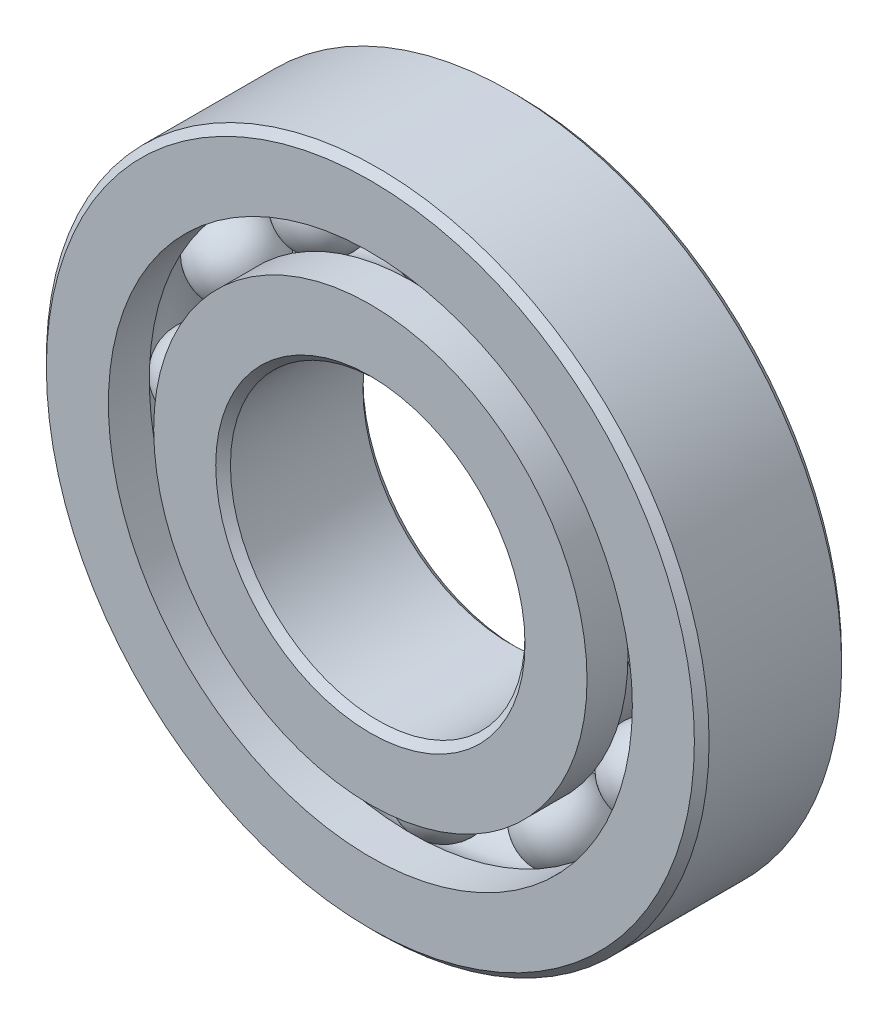
ISO-10303-21;
HEADER;
FILE_DESCRIPTION(('STEP AP214'),'2;1');
FILE_NAME('part.step','',(''),(''),'','','');
FILE_SCHEMA(('AUTOMOTIVE_DESIGN { 1 0 10303 214 1 1 1 1 }'));
ENDSEC;
DATA;
#1=APPLICATION_CONTEXT('core data for automotive mechanical design processes');
#2=APPLICATION_PROTOCOL_DEFINITION('international standard','automotive_design',2000,#1);
#3=PRODUCT_CONTEXT('',#1,'mechanical');
#4=PRODUCT('Part','Part','',(#3));
#5=PRODUCT_RELATED_PRODUCT_CATEGORY('part','',(#4));
#6=PRODUCT_DEFINITION_FORMATION('','',#4);
#7=PRODUCT_DEFINITION_CONTEXT('part definition',#1,'design');
#8=PRODUCT_DEFINITION('design','',#6,#7);
#9=PRODUCT_DEFINITION_SHAPE('','',#8);
#10=(LENGTH_UNIT() NAMED_UNIT(*) SI_UNIT(.MILLI.,.METRE.));
#11=(NAMED_UNIT(*) PLANE_ANGLE_UNIT() SI_UNIT($,.RADIAN.));
#12=(NAMED_UNIT(*) SI_UNIT($,.STERADIAN.) SOLID_ANGLE_UNIT());
#13=UNCERTAINTY_MEASURE_WITH_UNIT(LENGTH_MEASURE(1.E-05),#10,'distance_accuracy_value','');
#14=(GEOMETRIC_REPRESENTATION_CONTEXT(3) GLOBAL_UNCERTAINTY_ASSIGNED_CONTEXT((#13)) GLOBAL_UNIT_ASSIGNED_CONTEXT((#10,
#11,#12)) REPRESENTATION_CONTEXT('',''));
#15=CARTESIAN_POINT('',(0.,0.,0.));
#16=DIRECTION('',(0.,0.,1.));
#17=DIRECTION('',(1.,0.,0.));
#18=AXIS2_PLACEMENT_3D('',#15,#16,#17);
#19=CARTESIAN_POINT('',(-5.15937499999989,8.93629963530074,0.));
#20=DIRECTION('',(0.,0.,1.));
#21=DIRECTION('',(-0.499999999999989,0.866025403784445,0.));
#22=AXIS2_PLACEMENT_3D('',#19,#20,#21);
#23=SPHERICAL_SURFACE('',#22,1.71627890103156);
#24=CARTESIAN_POINT('',(-5.15937499999989,8.93629963530074,1.71627890103155));
#25=VERTEX_POINT('',#24);
#26=VERTEX_LOOP('',#25);
#27=FACE_BOUND('',#26,.T.);
#28=ADVANCED_FACE('F37',(#27),#23,.T.);
#29=CLOSED_SHELL('',(#28));
#30=MANIFOLD_SOLID_BREP('B2',#29);
#31=CARTESIAN_POINT('',(-8.93629963530062,5.1593750000001,0.));
#32=DIRECTION('',(0.,0.,1.));
#33=DIRECTION('',(-0.866025403784433,0.50000000000001,0.));
#34=AXIS2_PLACEMENT_3D('',#31,#32,#33);
#35=SPHERICAL_SURFACE('',#34,1.71627890103156);
#36=CARTESIAN_POINT('',(-8.93629963530062,5.1593750000001,1.71627890103155));
#37=VERTEX_POINT('',#36);
#38=VERTEX_LOOP('',#37);
#39=FACE_BOUND('',#38,.T.);
#40=ADVANCED_FACE('F57',(#39),#35,.T.);
#41=CLOSED_SHELL('',(#40));
#42=MANIFOLD_SOLID_BREP('B6',#41);
#43=CARTESIAN_POINT('',(-10.31875,1.08083231797342E-13,0.));
#44=DIRECTION('',(0.,0.,1.));
#45=DIRECTION('',(-1.,0.,0.));
#46=AXIS2_PLACEMENT_3D('',#43,#44,#45);
#47=SPHERICAL_SURFACE('',#46,1.71627890103156);
#48=CARTESIAN_POINT('',(-10.31875,1.08083231797342E-13,1.71627890103155));
#49=VERTEX_POINT('',#48);
#50=VERTEX_LOOP('',#49);
#51=FACE_BOUND('',#50,.T.);
#52=ADVANCED_FACE('F77',(#51),#47,.T.);
#53=CLOSED_SHELL('',(#52));
#54=MANIFOLD_SOLID_BREP('B33',#53);
#55=CARTESIAN_POINT('',(-8.93629963530072,-5.15937499999992,0.));
#56=DIRECTION('',(0.,0.,1.));
#57=DIRECTION('',(-0.866025403784443,-0.499999999999992,0.));
#58=AXIS2_PLACEMENT_3D('',#55,#56,#57);
#59=SPHERICAL_SURFACE('',#58,1.71627890103156);
#60=CARTESIAN_POINT('',(-8.93629963530072,-5.15937499999992,1.71627890103155));
#61=VERTEX_POINT('',#60);
#62=VERTEX_LOOP('',#61);
#63=FACE_BOUND('',#62,.T.);
#64=ADVANCED_FACE('F97',(#63),#59,.T.);
#65=CLOSED_SHELL('',(#64));
#66=MANIFOLD_SOLID_BREP('B53',#65);
#67=CARTESIAN_POINT('',(-5.15937500000007,-8.93629963530064,0.));
#68=DIRECTION('',(0.,0.,1.));
#69=DIRECTION('',(-0.500000000000007,-0.866025403784435,0.));
#70=AXIS2_PLACEMENT_3D('',#67,#68,#69);
#71=SPHERICAL_SURFACE('',#70,1.71627890103156);
#72=CARTESIAN_POINT('',(-5.15937500000007,-8.93629963530064,1.71627890103155));
#73=VERTEX_POINT('',#72);
#74=VERTEX_LOOP('',#73);
#75=FACE_BOUND('',#74,.T.);
#76=ADVANCED_FACE('F117',(#75),#71,.T.);
#77=CLOSED_SHELL('',(#76));
#78=MANIFOLD_SOLID_BREP('B73',#77);
#79=CARTESIAN_POINT('',(0.,-10.31875,0.));
#80=DIRECTION('',(0.,0.,1.));
#81=DIRECTION('',(0.,-1.,0.));
#82=AXIS2_PLACEMENT_3D('',#79,#80,#81);
#83=SPHERICAL_SURFACE('',#82,1.71627890103156);
#84=CARTESIAN_POINT('',(0.,-10.31875,1.71627890103155));
#85=VERTEX_POINT('',#84);
#86=VERTEX_LOOP('',#85);
#87=FACE_BOUND('',#86,.T.);
#88=ADVANCED_FACE('F137',(#87),#83,.T.);
#89=CLOSED_SHELL('',(#88));
#90=MANIFOLD_SOLID_BREP('B93',#89);
#91=CARTESIAN_POINT('',(5.15937499999995,-8.93629963530071,0.));
#92=DIRECTION('',(0.,0.,1.));
#93=DIRECTION('',(0.499999999999995,-0.866025403784442,0.));
#94=AXIS2_PLACEMENT_3D('',#91,#92,#93);
#95=SPHERICAL_SURFACE('',#94,1.71627890103156);
#96=CARTESIAN_POINT('',(5.15937499999995,-8.93629963530071,1.71627890103155));
#97=VERTEX_POINT('',#96);
#98=VERTEX_LOOP('',#97);
#99=FACE_BOUND('',#98,.T.);
#100=ADVANCED_FACE('F157',(#99),#95,.T.);
#101=CLOSED_SHELL('',(#100));
#102=MANIFOLD_SOLID_BREP('B113',#101);
#103=CARTESIAN_POINT('',(8.93629963530065,-5.15937500000004,0.));
#104=DIRECTION('',(0.,0.,1.));
#105=DIRECTION('',(0.866025403784436,-0.500000000000004,0.));
#106=AXIS2_PLACEMENT_3D('',#103,#104,#105);
#107=SPHERICAL_SURFACE('',#106,1.71627890103156);
#108=CARTESIAN_POINT('',(8.93629963530065,-5.15937500000004,1.71627890103155));
#109=VERTEX_POINT('',#108);
#110=VERTEX_LOOP('',#109);
#111=FACE_BOUND('',#110,.T.);
#112=ADVANCED_FACE('F177',(#111),#107,.T.);
#113=CLOSED_SHELL('',(#112));
#114=MANIFOLD_SOLID_BREP('B133',#113);
#115=CARTESIAN_POINT('',(10.31875,0.,0.));
#116=DIRECTION('',(0.,0.,1.));
#117=DIRECTION('',(1.,0.,0.));
#118=AXIS2_PLACEMENT_3D('',#115,#116,#117);
#119=SPHERICAL_SURFACE('',#118,1.71627890103156);
#120=CARTESIAN_POINT('',(10.31875,0.,1.71627890103155));
#121=VERTEX_POINT('',#120);
#122=VERTEX_LOOP('',#121);
#123=FACE_BOUND('',#122,.T.);
#124=ADVANCED_FACE('F197',(#123),#119,.T.);
#125=CLOSED_SHELL('',(#124));
#126=MANIFOLD_SOLID_BREP('B153',#125);
#127=CARTESIAN_POINT('',(8.93629963530069,5.15937499999998,0.));
#128=DIRECTION('',(0.,0.,1.));
#129=DIRECTION('',(0.86602540378444,0.499999999999998,0.));
#130=AXIS2_PLACEMENT_3D('',#127,#128,#129);
#131=SPHERICAL_SURFACE('',#130,1.71627890103156);
#132=CARTESIAN_POINT('',(8.93629963530069,5.15937499999998,1.71627890103155));
#133=VERTEX_POINT('',#132);
#134=VERTEX_LOOP('',#133);
#135=FACE_BOUND('',#134,.T.);
#136=ADVANCED_FACE('F217',(#135),#131,.T.);
#137=CLOSED_SHELL('',(#136));
#138=MANIFOLD_SOLID_BREP('B173',#137);
#139=CARTESIAN_POINT('',(5.15937500000001,8.93629963530067,0.));
#140=DIRECTION('',(0.,0.,1.));
#141=DIRECTION('',(0.500000000000001,0.866025403784438,0.));
#142=AXIS2_PLACEMENT_3D('',#139,#140,#141);
#143=SPHERICAL_SURFACE('',#142,1.71627890103156);
#144=CARTESIAN_POINT('',(5.15937500000001,8.93629963530067,1.71627890103155));
#145=VERTEX_POINT('',#144);
#146=VERTEX_LOOP('',#145);
#147=FACE_BOUND('',#146,.T.);
#148=ADVANCED_FACE('F237',(#147),#143,.T.);
#149=CLOSED_SHELL('',(#148));
#150=MANIFOLD_SOLID_BREP('B193',#149);
#151=CARTESIAN_POINT('',(0.,10.31875,0.));
#152=DIRECTION('',(0.,0.,1.));
#153=DIRECTION('',(0.,1.,0.));
#154=AXIS2_PLACEMENT_3D('',#151,#152,#153);
#155=SPHERICAL_SURFACE('',#154,1.71627890103156);
#156=CARTESIAN_POINT('',(0.,10.31875,1.71627890103155));
#157=VERTEX_POINT('',#156);
#158=VERTEX_LOOP('',#157);
#159=FACE_BOUND('',#158,.T.);
#160=ADVANCED_FACE('F259',(#159),#155,.T.);
#161=CLOSED_SHELL('',(#160));
#162=MANIFOLD_SOLID_BREP('B213',#161);
#163=CARTESIAN_POINT('',(0.,9.34182692307692,3.175));
#164=DIRECTION('',(0.,0.,-1.));
#165=DIRECTION('',(-1.,0.,0.));
#166=AXIS2_PLACEMENT_3D('',#163,#164,#165);
#167=PLANE('',#166);
#168=CARTESIAN_POINT('',(0.,0.,3.175));
#169=DIRECTION('',(0.,0.,1.));
#170=DIRECTION('',(1.,0.,0.));
#171=AXIS2_PLACEMENT_3D('',#168,#169,#170);
#172=CIRCLE('',#171,6.6675);
#173=CARTESIAN_POINT('',(6.6675,0.,3.175));
#174=VERTEX_POINT('',#173);
#175=EDGE_CURVE('E306',#174,#174,#172,.T.);
#176=ORIENTED_EDGE('',*,*,#175,.F.);
#177=EDGE_LOOP('',(#176));
#178=FACE_BOUND('',#177,.T.);
#179=CARTESIAN_POINT('',(0.,0.,3.175));
#180=DIRECTION('',(0.,0.,1.));
#181=DIRECTION('',(1.,0.,0.));
#182=AXIS2_PLACEMENT_3D('',#179,#180,#181);
#183=CIRCLE('',#182,9.34182692307692);
#184=CARTESIAN_POINT('',(9.34182692307692,0.,3.175));
#185=VERTEX_POINT('',#184);
#186=EDGE_CURVE('E258',#185,#185,#183,.T.);
#187=ORIENTED_EDGE('',*,*,#186,.T.);
#188=EDGE_LOOP('',(#187));
#189=FACE_BOUND('',#188,.T.);
#190=ADVANCED_FACE('F278',(#178,#189),#167,.F.);
#191=CARTESIAN_POINT('',(0.,0.,3.175));
#192=DIRECTION('',(0.,0.,1.));
#193=DIRECTION('',(1.,0.,0.));
#194=AXIS2_PLACEMENT_3D('',#191,#192,#193);
#195=CYLINDRICAL_SURFACE('',#194,9.34182692307692);
#196=ORIENTED_EDGE('',*,*,#186,.F.);
#197=EDGE_LOOP('',(#196));
#198=FACE_BOUND('',#197,.T.);
#199=CARTESIAN_POINT('',(0.,0.,1.41111111111111));
#200=DIRECTION('',(0.,0.,1.));
#201=DIRECTION('',(1.,0.,0.));
#202=AXIS2_PLACEMENT_3D('',#199,#200,#201);
#203=CIRCLE('',#202,9.34182692307692);
#204=CARTESIAN_POINT('',(9.34182692307692,0.,1.41111111111111));
#205=VERTEX_POINT('',#204);
#206=EDGE_CURVE('E284',#205,#205,#203,.T.);
#207=ORIENTED_EDGE('',*,*,#206,.T.);
#208=EDGE_LOOP('',(#207));
#209=FACE_BOUND('',#208,.T.);
#210=ADVANCED_FACE('F313',(#198,#209),#195,.T.);
#211=CARTESIAN_POINT('',(0.,0.,0.));
#212=DIRECTION('',(0.,0.,1.));
#213=DIRECTION('',(1.,0.,0.));
#214=AXIS2_PLACEMENT_3D('',#211,#212,#213);
#215=TOROIDAL_SURFACE('',#214,10.31875,1.71627890103155);
#216=ORIENTED_EDGE('',*,*,#206,.F.);
#217=EDGE_LOOP('',(#216));
#218=FACE_BOUND('',#217,.T.);
#219=CARTESIAN_POINT('',(0.,0.,-1.41111111111111));
#220=DIRECTION('',(0.,0.,1.));
#221=DIRECTION('',(1.,0.,0.));
#222=AXIS2_PLACEMENT_3D('',#219,#220,#221);
#223=CIRCLE('',#222,9.34182692307692);
#224=CARTESIAN_POINT('',(9.34182692307692,0.,-1.41111111111111));
#225=VERTEX_POINT('',#224);
#226=EDGE_CURVE('E288',#225,#225,#223,.T.);
#227=ORIENTED_EDGE('',*,*,#226,.T.);
#228=EDGE_LOOP('',(#227));
#229=FACE_BOUND('',#228,.T.);
#230=ADVANCED_FACE('F317',(#218,#229),#215,.F.);
#231=CARTESIAN_POINT('',(0.,0.,3.175));
#232=DIRECTION('',(0.,0.,1.));
#233=DIRECTION('',(1.,0.,0.));
#234=AXIS2_PLACEMENT_3D('',#231,#232,#233);
#235=CYLINDRICAL_SURFACE('',#234,9.34182692307692);
#236=ORIENTED_EDGE('',*,*,#226,.F.);
#237=EDGE_LOOP('',(#236));
#238=FACE_BOUND('',#237,.T.);
#239=CARTESIAN_POINT('',(0.,0.,-3.175));
#240=DIRECTION('',(0.,0.,1.));
#241=DIRECTION('',(1.,0.,0.));
#242=AXIS2_PLACEMENT_3D('',#239,#240,#241);
#243=CIRCLE('',#242,9.34182692307692);
#244=CARTESIAN_POINT('',(9.34182692307692,0.,-3.175));
#245=VERTEX_POINT('',#244);
#246=EDGE_CURVE('E292',#245,#245,#243,.T.);
#247=ORIENTED_EDGE('',*,*,#246,.T.);
#248=EDGE_LOOP('',(#247));
#249=FACE_BOUND('',#248,.T.);
#250=ADVANCED_FACE('F322',(#238,#249),#235,.T.);
#251=CARTESIAN_POINT('',(0.,6.6675,-3.175));
#252=DIRECTION('',(0.,0.,1.));
#253=DIRECTION('',(1.,0.,0.));
#254=AXIS2_PLACEMENT_3D('',#251,#252,#253);
#255=PLANE('',#254);
#256=ORIENTED_EDGE('',*,*,#246,.F.);
#257=EDGE_LOOP('',(#256));
#258=FACE_BOUND('',#257,.T.);
#259=CARTESIAN_POINT('',(0.,0.,-3.175));
#260=DIRECTION('',(0.,0.,1.));
#261=DIRECTION('',(1.,0.,0.));
#262=AXIS2_PLACEMENT_3D('',#259,#260,#261);
#263=CIRCLE('',#262,6.6675);
#264=CARTESIAN_POINT('',(6.6675,0.,-3.175));
#265=VERTEX_POINT('',#264);
#266=EDGE_CURVE('E297',#265,#265,#263,.T.);
#267=ORIENTED_EDGE('',*,*,#266,.T.);
#268=EDGE_LOOP('',(#267));
#269=FACE_BOUND('',#268,.T.);
#270=ADVANCED_FACE('F328',(#258,#269),#255,.F.);
#271=CARTESIAN_POINT('',(0.,0.,-2.8575));
#272=DIRECTION('',(0.,0.,-1.));
#273=DIRECTION('',(-1.,0.,0.));
#274=AXIS2_PLACEMENT_3D('',#271,#272,#273);
#275=CONICAL_SURFACE('',#274,6.35,0.785398163397452);
#276=ORIENTED_EDGE('',*,*,#266,.F.);
#277=EDGE_LOOP('',(#276));
#278=FACE_BOUND('',#277,.T.);
#279=CARTESIAN_POINT('',(0.,0.,-2.8575));
#280=DIRECTION('',(0.,0.,1.));
#281=DIRECTION('',(1.,0.,0.));
#282=AXIS2_PLACEMENT_3D('',#279,#280,#281);
#283=CIRCLE('',#282,6.35);
#284=CARTESIAN_POINT('',(6.35,0.,-2.8575));
#285=VERTEX_POINT('',#284);
#286=EDGE_CURVE('E300',#285,#285,#283,.T.);
#287=ORIENTED_EDGE('',*,*,#286,.T.);
#288=EDGE_LOOP('',(#287));
#289=FACE_BOUND('',#288,.T.);
#290=ADVANCED_FACE('F332',(#278,#289),#275,.F.);
#291=CARTESIAN_POINT('',(0.,0.,3.175));
#292=DIRECTION('',(0.,0.,1.));
#293=DIRECTION('',(1.,0.,0.));
#294=AXIS2_PLACEMENT_3D('',#291,#292,#293);
#295=CYLINDRICAL_SURFACE('',#294,6.35);
#296=ORIENTED_EDGE('',*,*,#286,.F.);
#297=EDGE_LOOP('',(#296));
#298=FACE_BOUND('',#297,.T.);
#299=CARTESIAN_POINT('',(0.,0.,2.8575));
#300=DIRECTION('',(0.,0.,1.));
#301=DIRECTION('',(1.,0.,0.));
#302=AXIS2_PLACEMENT_3D('',#299,#300,#301);
#303=CIRCLE('',#302,6.35);
#304=CARTESIAN_POINT('',(6.35,0.,2.8575));
#305=VERTEX_POINT('',#304);
#306=EDGE_CURVE('E303',#305,#305,#303,.T.);
#307=ORIENTED_EDGE('',*,*,#306,.T.);
#308=EDGE_LOOP('',(#307));
#309=FACE_BOUND('',#308,.T.);
#310=ADVANCED_FACE('F336',(#298,#309),#295,.F.);
#311=CARTESIAN_POINT('',(0.,0.,3.175));
#312=DIRECTION('',(0.,0.,1.));
#313=DIRECTION('',(1.,0.,0.));
#314=AXIS2_PLACEMENT_3D('',#311,#312,#313);
#315=CONICAL_SURFACE('',#314,6.6675,0.785398163397444);
#316=ORIENTED_EDGE('',*,*,#306,.F.);
#317=EDGE_LOOP('',(#316));
#318=FACE_BOUND('',#317,.T.);
#319=ORIENTED_EDGE('',*,*,#175,.T.);
#320=EDGE_LOOP('',(#319));
#321=FACE_BOUND('',#320,.T.);
#322=ADVANCED_FACE('F310',(#318,#321),#315,.F.);
#323=CLOSED_SHELL('',(#190,#210,#230,#250,#270,#290,#310,#322));
#324=MANIFOLD_SOLID_BREP('B233',#323);
#325=CARTESIAN_POINT('',(0.,0.,2.8575));
#326=DIRECTION('',(0.,0.,-1.));
#327=DIRECTION('',(-1.,0.,0.));
#328=AXIS2_PLACEMENT_3D('',#325,#326,#327);
#329=CONICAL_SURFACE('',#328,14.2875,0.785398163397448);
#330=CARTESIAN_POINT('',(0.,0.,3.175));
#331=DIRECTION('',(0.,0.,1.));
#332=DIRECTION('',(1.,0.,0.));
#333=AXIS2_PLACEMENT_3D('',#330,#331,#332);
#334=CIRCLE('',#333,13.97);
#335=CARTESIAN_POINT('',(13.97,0.,3.175));
#336=VERTEX_POINT('',#335);
#337=EDGE_CURVE('E427',#336,#336,#334,.T.);
#338=ORIENTED_EDGE('',*,*,#337,.F.);
#339=EDGE_LOOP('',(#338));
#340=FACE_BOUND('',#339,.T.);
#341=CARTESIAN_POINT('',(0.,0.,2.8575));
#342=DIRECTION('',(0.,0.,1.));
#343=DIRECTION('',(1.,0.,0.));
#344=AXIS2_PLACEMENT_3D('',#341,#342,#343);
#345=CIRCLE('',#344,14.2875);
#346=CARTESIAN_POINT('',(14.2875,0.,2.8575));
#347=VERTEX_POINT('',#346);
#348=EDGE_CURVE('E277',#347,#347,#345,.T.);
#349=ORIENTED_EDGE('',*,*,#348,.T.);
#350=EDGE_LOOP('',(#349));
#351=FACE_BOUND('',#350,.T.);
#352=ADVANCED_FACE('F399',(#340,#351),#329,.T.);
#353=CARTESIAN_POINT('',(0.,0.,3.175));
#354=DIRECTION('',(0.,0.,1.));
#355=DIRECTION('',(1.,0.,0.));
#356=AXIS2_PLACEMENT_3D('',#353,#354,#355);
#357=CYLINDRICAL_SURFACE('',#356,14.2875);
#358=ORIENTED_EDGE('',*,*,#348,.F.);
#359=EDGE_LOOP('',(#358));
#360=FACE_BOUND('',#359,.T.);
#361=CARTESIAN_POINT('',(0.,0.,-2.8575));
#362=DIRECTION('',(0.,0.,1.));
#363=DIRECTION('',(1.,0.,0.));
#364=AXIS2_PLACEMENT_3D('',#361,#362,#363);
#365=CIRCLE('',#364,14.2875);
#366=CARTESIAN_POINT('',(14.2875,0.,-2.8575));
#367=VERTEX_POINT('',#366);
#368=EDGE_CURVE('E405',#367,#367,#365,.T.);
#369=ORIENTED_EDGE('',*,*,#368,.T.);
#370=EDGE_LOOP('',(#369));
#371=FACE_BOUND('',#370,.T.);
#372=ADVANCED_FACE('F434',(#360,#371),#357,.T.);
#373=CARTESIAN_POINT('',(0.,0.,-3.175));
#374=DIRECTION('',(0.,0.,1.));
#375=DIRECTION('',(1.,0.,0.));
#376=AXIS2_PLACEMENT_3D('',#373,#374,#375);
#377=CONICAL_SURFACE('',#376,13.97,0.785398163397448);
#378=ORIENTED_EDGE('',*,*,#368,.F.);
#379=EDGE_LOOP('',(#378));
#380=FACE_BOUND('',#379,.T.);
#381=CARTESIAN_POINT('',(0.,0.,-3.175));
#382=DIRECTION('',(0.,0.,1.));
#383=DIRECTION('',(1.,0.,0.));
#384=AXIS2_PLACEMENT_3D('',#381,#382,#383);
#385=CIRCLE('',#384,13.97);
#386=CARTESIAN_POINT('',(13.97,0.,-3.175));
#387=VERTEX_POINT('',#386);
#388=EDGE_CURVE('E409',#387,#387,#385,.T.);
#389=ORIENTED_EDGE('',*,*,#388,.T.);
#390=EDGE_LOOP('',(#389));
#391=FACE_BOUND('',#390,.T.);
#392=ADVANCED_FACE('F438',(#380,#391),#377,.T.);
#393=CARTESIAN_POINT('',(0.,13.97,-3.175));
#394=DIRECTION('',(0.,0.,1.));
#395=DIRECTION('',(1.,0.,0.));
#396=AXIS2_PLACEMENT_3D('',#393,#394,#395);
#397=PLANE('',#396);
#398=ORIENTED_EDGE('',*,*,#388,.F.);
#399=EDGE_LOOP('',(#398));
#400=FACE_BOUND('',#399,.T.);
#401=CARTESIAN_POINT('',(0.,0.,-3.175));
#402=DIRECTION('',(0.,0.,1.));
#403=DIRECTION('',(1.,0.,0.));
#404=AXIS2_PLACEMENT_3D('',#401,#402,#403);
#405=CIRCLE('',#404,11.2956730769231);
#406=CARTESIAN_POINT('',(11.2956730769231,0.,-3.175));
#407=VERTEX_POINT('',#406);
#408=EDGE_CURVE('E413',#407,#407,#405,.T.);
#409=ORIENTED_EDGE('',*,*,#408,.T.);
#410=EDGE_LOOP('',(#409));
#411=FACE_BOUND('',#410,.T.);
#412=ADVANCED_FACE('F443',(#400,#411),#397,.F.);
#413=CARTESIAN_POINT('',(0.,0.,3.175));
#414=DIRECTION('',(0.,0.,1.));
#415=DIRECTION('',(1.,0.,0.));
#416=AXIS2_PLACEMENT_3D('',#413,#414,#415);
#417=CYLINDRICAL_SURFACE('',#416,11.2956730769231);
#418=ORIENTED_EDGE('',*,*,#408,.F.);
#419=EDGE_LOOP('',(#418));
#420=FACE_BOUND('',#419,.T.);
#421=CARTESIAN_POINT('',(0.,0.,-1.41111111111111));
#422=DIRECTION('',(0.,0.,1.));
#423=DIRECTION('',(1.,0.,0.));
#424=AXIS2_PLACEMENT_3D('',#421,#422,#423);
#425=CIRCLE('',#424,11.2956730769231);
#426=CARTESIAN_POINT('',(11.2956730769231,0.,-1.41111111111111));
#427=VERTEX_POINT('',#426);
#428=EDGE_CURVE('E418',#427,#427,#425,.T.);
#429=ORIENTED_EDGE('',*,*,#428,.T.);
#430=EDGE_LOOP('',(#429));
#431=FACE_BOUND('',#430,.T.);
#432=ADVANCED_FACE('F449',(#420,#431),#417,.F.);
#433=CARTESIAN_POINT('',(0.,0.,0.));
#434=DIRECTION('',(0.,0.,1.));
#435=DIRECTION('',(1.,0.,0.));
#436=AXIS2_PLACEMENT_3D('',#433,#434,#435);
#437=TOROIDAL_SURFACE('',#436,10.31875,1.71627890103156);
#438=ORIENTED_EDGE('',*,*,#428,.F.);
#439=EDGE_LOOP('',(#438));
#440=FACE_BOUND('',#439,.T.);
#441=CARTESIAN_POINT('',(0.,0.,1.41111111111111));
#442=DIRECTION('',(0.,0.,1.));
#443=DIRECTION('',(1.,0.,0.));
#444=AXIS2_PLACEMENT_3D('',#441,#442,#443);
#445=CIRCLE('',#444,11.2956730769231);
#446=CARTESIAN_POINT('',(11.2956730769231,0.,1.41111111111111));
#447=VERTEX_POINT('',#446);
#448=EDGE_CURVE('E421',#447,#447,#445,.T.);
#449=ORIENTED_EDGE('',*,*,#448,.T.);
#450=EDGE_LOOP('',(#449));
#451=FACE_BOUND('',#450,.T.);
#452=ADVANCED_FACE('F453',(#440,#451),#437,.F.);
#453=CARTESIAN_POINT('',(0.,0.,3.175));
#454=DIRECTION('',(0.,0.,1.));
#455=DIRECTION('',(1.,0.,0.));
#456=AXIS2_PLACEMENT_3D('',#453,#454,#455);
#457=CYLINDRICAL_SURFACE('',#456,11.2956730769231);
#458=ORIENTED_EDGE('',*,*,#448,.F.);
#459=EDGE_LOOP('',(#458));
#460=FACE_BOUND('',#459,.T.);
#461=CARTESIAN_POINT('',(0.,0.,3.175));
#462=DIRECTION('',(0.,0.,1.));
#463=DIRECTION('',(1.,0.,0.));
#464=AXIS2_PLACEMENT_3D('',#461,#462,#463);
#465=CIRCLE('',#464,11.2956730769231);
#466=CARTESIAN_POINT('',(11.2956730769231,0.,3.175));
#467=VERTEX_POINT('',#466);
#468=EDGE_CURVE('E424',#467,#467,#465,.T.);
#469=ORIENTED_EDGE('',*,*,#468,.T.);
#470=EDGE_LOOP('',(#469));
#471=FACE_BOUND('',#470,.T.);
#472=ADVANCED_FACE('F457',(#460,#471),#457,.F.);
#473=CARTESIAN_POINT('',(0.,13.97,3.175));
#474=DIRECTION('',(0.,0.,-1.));
#475=DIRECTION('',(-1.,0.,0.));
#476=AXIS2_PLACEMENT_3D('',#473,#474,#475);
#477=PLANE('',#476);
#478=ORIENTED_EDGE('',*,*,#468,.F.);
#479=EDGE_LOOP('',(#478));
#480=FACE_BOUND('',#479,.T.);
#481=ORIENTED_EDGE('',*,*,#337,.T.);
#482=EDGE_LOOP('',(#481));
#483=FACE_BOUND('',#482,.T.);
#484=ADVANCED_FACE('F431',(#480,#483),#477,.F.);
#485=CLOSED_SHELL('',(#352,#372,#392,#412,#432,#452,#472,#484));
#486=MANIFOLD_SOLID_BREP('B253',#485);
#487=ADVANCED_BREP_SHAPE_REPRESENTATION('',(#18,#30,#42,#54,#66,#78,#90,#102,#114,#126,#138,
#150,#162,#324,#486),#14);
#488=SHAPE_DEFINITION_REPRESENTATION(#9,#487);
ENDSEC;
END-ISO-10303-21;
